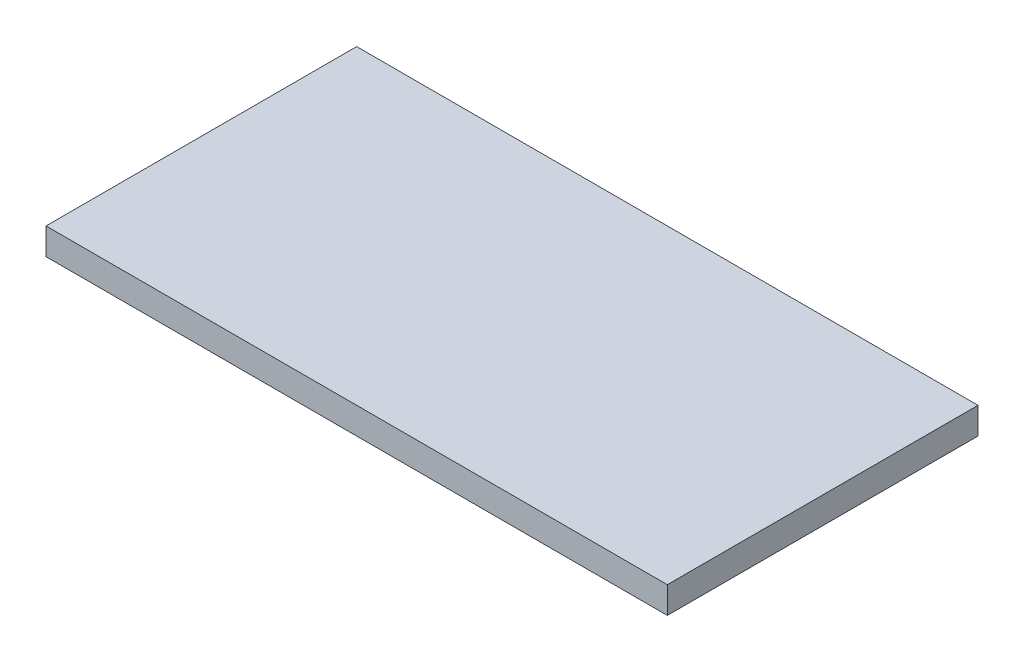
ISO-10303-21;
HEADER;
FILE_DESCRIPTION(('STEP AP214'),'2;1');
FILE_NAME('part.step','',(''),(''),'','','');
FILE_SCHEMA(('AUTOMOTIVE_DESIGN { 1 0 10303 214 1 1 1 1 }'));
ENDSEC;
DATA;
#1=APPLICATION_CONTEXT('core data for automotive mechanical design processes');
#2=APPLICATION_PROTOCOL_DEFINITION('international standard','automotive_design',2000,#1);
#3=PRODUCT_CONTEXT('',#1,'mechanical');
#4=PRODUCT('Part','Part','',(#3));
#5=PRODUCT_RELATED_PRODUCT_CATEGORY('part','',(#4));
#6=PRODUCT_DEFINITION_FORMATION('','',#4);
#7=PRODUCT_DEFINITION_CONTEXT('part definition',#1,'design');
#8=PRODUCT_DEFINITION('design','',#6,#7);
#9=PRODUCT_DEFINITION_SHAPE('','',#8);
#10=(LENGTH_UNIT() NAMED_UNIT(*) SI_UNIT(.MILLI.,.METRE.));
#11=(NAMED_UNIT(*) PLANE_ANGLE_UNIT() SI_UNIT($,.RADIAN.));
#12=(NAMED_UNIT(*) SI_UNIT($,.STERADIAN.) SOLID_ANGLE_UNIT());
#13=UNCERTAINTY_MEASURE_WITH_UNIT(LENGTH_MEASURE(1.E-05),#10,'distance_accuracy_value','');
#14=(GEOMETRIC_REPRESENTATION_CONTEXT(3) GLOBAL_UNCERTAINTY_ASSIGNED_CONTEXT((#13)) GLOBAL_UNIT_ASSIGNED_CONTEXT((#10,
#11,#12)) REPRESENTATION_CONTEXT('',''));
#15=CARTESIAN_POINT('',(0.,0.,0.));
#16=DIRECTION('',(0.,0.,1.));
#17=DIRECTION('',(1.,0.,0.));
#18=AXIS2_PLACEMENT_3D('',#15,#16,#17);
#19=CARTESIAN_POINT('',(0.,30.,0.));
#20=DIRECTION('',(1.,0.,0.));
#21=DIRECTION('',(0.,0.,-1.));
#22=AXIS2_PLACEMENT_3D('',#19,#20,#21);
#23=PLANE('',#22);
#24=DIRECTION('',(0.,0.,1.));
#25=VECTOR('',#24,1.);
#26=CARTESIAN_POINT('',(0.,0.,0.));
#27=LINE('',#26,#25);
#28=CARTESIAN_POINT('',(0.,0.,-350.));
#29=VERTEX_POINT('',#28);
#30=CARTESIAN_POINT('',(0.,0.,0.));
#31=VERTEX_POINT('',#30);
#32=EDGE_CURVE('E98',#29,#31,#27,.T.);
#33=ORIENTED_EDGE('',*,*,#32,.T.);
#34=DIRECTION('',(0.,-1.,0.));
#35=VECTOR('',#34,1.);
#36=CARTESIAN_POINT('',(0.,30.,0.));
#37=LINE('',#36,#35);
#38=CARTESIAN_POINT('',(0.,30.,0.));
#39=VERTEX_POINT('',#38);
#40=EDGE_CURVE('E11',#39,#31,#37,.T.);
#41=ORIENTED_EDGE('',*,*,#40,.F.);
#42=DIRECTION('',(0.,0.,1.));
#43=VECTOR('',#42,1.);
#44=CARTESIAN_POINT('',(0.,30.,0.));
#45=LINE('',#44,#43);
#46=CARTESIAN_POINT('',(0.,30.,-350.));
#47=VERTEX_POINT('',#46);
#48=EDGE_CURVE('E86',#47,#39,#45,.T.);
#49=ORIENTED_EDGE('',*,*,#48,.F.);
#50=DIRECTION('',(0.,-1.,0.));
#51=VECTOR('',#50,1.);
#52=CARTESIAN_POINT('',(0.,30.,-350.));
#53=LINE('',#52,#51);
#54=EDGE_CURVE('E94',#47,#29,#53,.T.);
#55=ORIENTED_EDGE('',*,*,#54,.T.);
#56=EDGE_LOOP('',(#33,#41,#49,#55));
#57=FACE_BOUND('',#56,.T.);
#58=ADVANCED_FACE('F35',(#57),#23,.F.);
#59=CARTESIAN_POINT('',(0.,30.,0.));
#60=DIRECTION('',(0.,0.,-1.));
#61=DIRECTION('',(-1.,0.,0.));
#62=AXIS2_PLACEMENT_3D('',#59,#60,#61);
#63=PLANE('',#62);
#64=DIRECTION('',(1.,0.,0.));
#65=VECTOR('',#64,1.);
#66=CARTESIAN_POINT('',(0.,0.,0.));
#67=LINE('',#66,#65);
#68=CARTESIAN_POINT('',(700.,0.,0.));
#69=VERTEX_POINT('',#68);
#70=EDGE_CURVE('E90',#31,#69,#67,.T.);
#71=ORIENTED_EDGE('',*,*,#70,.T.);
#72=DIRECTION('',(0.,-1.,0.));
#73=VECTOR('',#72,1.);
#74=CARTESIAN_POINT('',(700.,30.,0.));
#75=LINE('',#74,#73);
#76=CARTESIAN_POINT('',(700.,30.,0.));
#77=VERTEX_POINT('',#76);
#78=EDGE_CURVE('E43',#77,#69,#75,.T.);
#79=ORIENTED_EDGE('',*,*,#78,.F.);
#80=DIRECTION('',(1.,0.,0.));
#81=VECTOR('',#80,1.);
#82=CARTESIAN_POINT('',(0.,30.,0.));
#83=LINE('',#82,#81);
#84=EDGE_CURVE('E81',#39,#77,#83,.T.);
#85=ORIENTED_EDGE('',*,*,#84,.F.);
#86=ORIENTED_EDGE('',*,*,#40,.T.);
#87=EDGE_LOOP('',(#71,#79,#85,#86));
#88=FACE_BOUND('',#87,.T.);
#89=ADVANCED_FACE('F89',(#88),#63,.F.);
#90=CARTESIAN_POINT('',(700.,30.,0.));
#91=DIRECTION('',(-1.,0.,0.));
#92=DIRECTION('',(0.,0.,1.));
#93=AXIS2_PLACEMENT_3D('',#90,#91,#92);
#94=PLANE('',#93);
#95=DIRECTION('',(0.,0.,-1.));
#96=VECTOR('',#95,1.);
#97=CARTESIAN_POINT('',(700.,0.,0.));
#98=LINE('',#97,#96);
#99=CARTESIAN_POINT('',(700.,0.,-350.));
#100=VERTEX_POINT('',#99);
#101=EDGE_CURVE('E68',#69,#100,#98,.T.);
#102=ORIENTED_EDGE('',*,*,#101,.T.);
#103=DIRECTION('',(0.,-1.,0.));
#104=VECTOR('',#103,1.);
#105=CARTESIAN_POINT('',(700.,30.,-350.));
#106=LINE('',#105,#104);
#107=CARTESIAN_POINT('',(700.,30.,-350.));
#108=VERTEX_POINT('',#107);
#109=EDGE_CURVE('E91',#108,#100,#106,.T.);
#110=ORIENTED_EDGE('',*,*,#109,.F.);
#111=DIRECTION('',(0.,0.,-1.));
#112=VECTOR('',#111,1.);
#113=CARTESIAN_POINT('',(700.,30.,0.));
#114=LINE('',#113,#112);
#115=EDGE_CURVE('E84',#77,#108,#114,.T.);
#116=ORIENTED_EDGE('',*,*,#115,.F.);
#117=ORIENTED_EDGE('',*,*,#78,.T.);
#118=EDGE_LOOP('',(#102,#110,#116,#117));
#119=FACE_BOUND('',#118,.T.);
#120=ADVANCED_FACE('F92',(#119),#94,.F.);
#121=CARTESIAN_POINT('',(0.,30.,-350.));
#122=DIRECTION('',(0.,0.,1.));
#123=DIRECTION('',(1.,0.,0.));
#124=AXIS2_PLACEMENT_3D('',#121,#122,#123);
#125=PLANE('',#124);
#126=DIRECTION('',(-1.,0.,0.));
#127=VECTOR('',#126,1.);
#128=CARTESIAN_POINT('',(0.,0.,-350.));
#129=LINE('',#128,#127);
#130=EDGE_CURVE('E74',#100,#29,#129,.T.);
#131=ORIENTED_EDGE('',*,*,#130,.T.);
#132=ORIENTED_EDGE('',*,*,#54,.F.);
#133=DIRECTION('',(-1.,0.,0.));
#134=VECTOR('',#133,1.);
#135=CARTESIAN_POINT('',(0.,30.,-350.));
#136=LINE('',#135,#134);
#137=EDGE_CURVE('E51',#108,#47,#136,.T.);
#138=ORIENTED_EDGE('',*,*,#137,.F.);
#139=ORIENTED_EDGE('',*,*,#109,.T.);
#140=EDGE_LOOP('',(#131,#132,#138,#139));
#141=FACE_BOUND('',#140,.T.);
#142=ADVANCED_FACE('F105',(#141),#125,.F.);
#143=CARTESIAN_POINT('',(0.,30.,0.));
#144=DIRECTION('',(0.,-1.,0.));
#145=DIRECTION('',(0.,0.,-1.));
#146=AXIS2_PLACEMENT_3D('',#143,#144,#145);
#147=PLANE('',#146);
#148=ORIENTED_EDGE('',*,*,#48,.T.);
#149=ORIENTED_EDGE('',*,*,#84,.T.);
#150=ORIENTED_EDGE('',*,*,#115,.T.);
#151=ORIENTED_EDGE('',*,*,#137,.T.);
#152=EDGE_LOOP('',(#148,#149,#150,#151));
#153=FACE_BOUND('',#152,.T.);
#154=ADVANCED_FACE('F82',(#153),#147,.F.);
#155=CARTESIAN_POINT('',(0.,0.,0.));
#156=DIRECTION('',(0.,-1.,0.));
#157=DIRECTION('',(0.,0.,-1.));
#158=AXIS2_PLACEMENT_3D('',#155,#156,#157);
#159=PLANE('',#158);
#160=ORIENTED_EDGE('',*,*,#32,.F.);
#161=ORIENTED_EDGE('',*,*,#130,.F.);
#162=ORIENTED_EDGE('',*,*,#101,.F.);
#163=ORIENTED_EDGE('',*,*,#70,.F.);
#164=EDGE_LOOP('',(#160,#161,#162,#163));
#165=FACE_BOUND('',#164,.T.);
#166=ADVANCED_FACE('F108',(#165),#159,.T.);
#167=CLOSED_SHELL('',(#58,#89,#120,#142,#154,#166));
#168=MANIFOLD_SOLID_BREP('B2',#167);
#169=ADVANCED_BREP_SHAPE_REPRESENTATION('',(#18,#168),#14);
#170=SHAPE_DEFINITION_REPRESENTATION(#9,#169);
ENDSEC;
END-ISO-10303-21;
